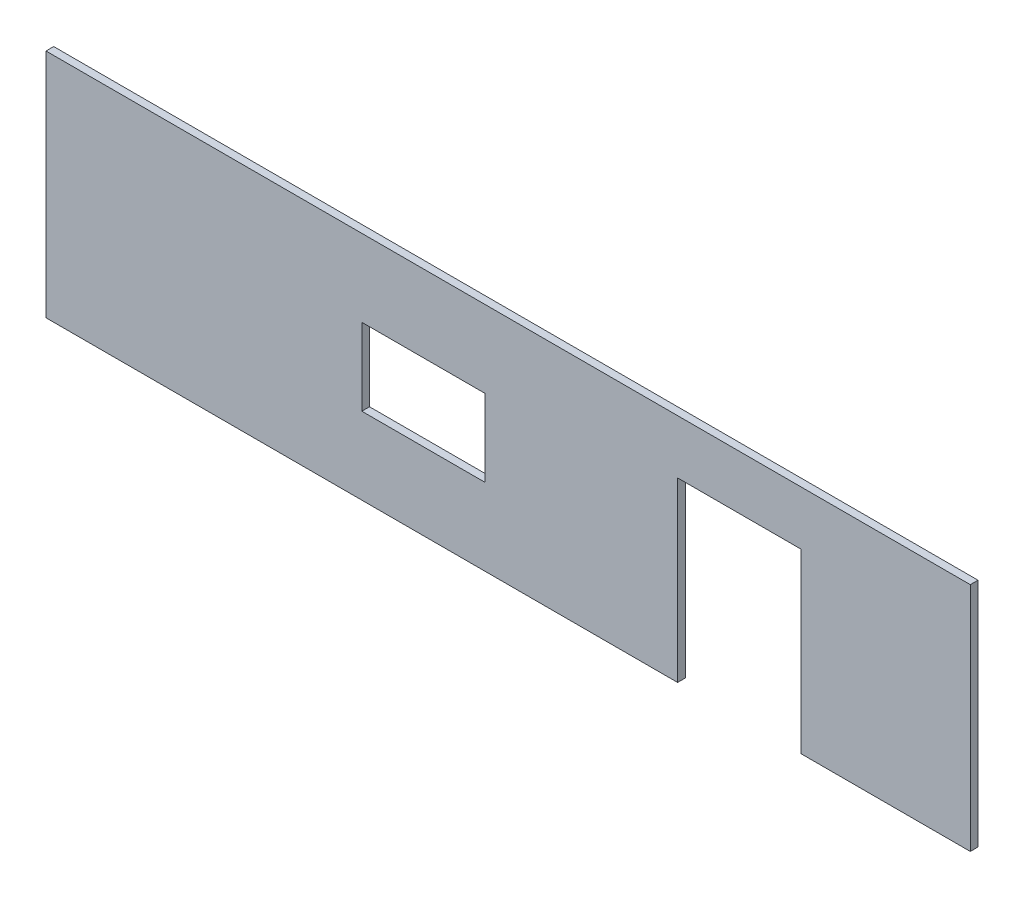
ISO-10303-21;
HEADER;
FILE_DESCRIPTION(('STEP AP214'),'2;1');
FILE_NAME('part.step','',(''),(''),'','','');
FILE_SCHEMA(('AUTOMOTIVE_DESIGN { 1 0 10303 214 1 1 1 1 }'));
ENDSEC;
DATA;
#1=APPLICATION_CONTEXT('core data for automotive mechanical design processes');
#2=APPLICATION_PROTOCOL_DEFINITION('international standard','automotive_design',2000,#1);
#3=PRODUCT_CONTEXT('',#1,'mechanical');
#4=PRODUCT('Part','Part','',(#3));
#5=PRODUCT_RELATED_PRODUCT_CATEGORY('part','',(#4));
#6=PRODUCT_DEFINITION_FORMATION('','',#4);
#7=PRODUCT_DEFINITION_CONTEXT('part definition',#1,'design');
#8=PRODUCT_DEFINITION('design','',#6,#7);
#9=PRODUCT_DEFINITION_SHAPE('','',#8);
#10=(LENGTH_UNIT() NAMED_UNIT(*) SI_UNIT(.MILLI.,.METRE.));
#11=(NAMED_UNIT(*) PLANE_ANGLE_UNIT() SI_UNIT($,.RADIAN.));
#12=(NAMED_UNIT(*) SI_UNIT($,.STERADIAN.) SOLID_ANGLE_UNIT());
#13=UNCERTAINTY_MEASURE_WITH_UNIT(LENGTH_MEASURE(1.E-05),#10,'distance_accuracy_value','');
#14=(GEOMETRIC_REPRESENTATION_CONTEXT(3) GLOBAL_UNCERTAINTY_ASSIGNED_CONTEXT((#13)) GLOBAL_UNIT_ASSIGNED_CONTEXT((#10,
#11,#12)) REPRESENTATION_CONTEXT('',''));
#15=CARTESIAN_POINT('',(0.,0.,0.));
#16=DIRECTION('',(0.,0.,1.));
#17=DIRECTION('',(1.,0.,0.));
#18=AXIS2_PLACEMENT_3D('',#15,#16,#17);
#19=CARTESIAN_POINT('',(0.,0.,5.));
#20=DIRECTION('',(0.,0.,-1.));
#21=DIRECTION('',(-1.,0.,0.));
#22=AXIS2_PLACEMENT_3D('',#19,#20,#21);
#23=PLANE('',#22);
#24=DIRECTION('',(1.,0.,0.));
#25=VECTOR('',#24,1.);
#26=CARTESIAN_POINT('',(190.,-75.,5.));
#27=LINE('',#26,#25);
#28=CARTESIAN_POINT('',(190.,-75.,5.));
#29=VERTEX_POINT('',#28);
#30=CARTESIAN_POINT('',(300.,-75.,5.));
#31=VERTEX_POINT('',#30);
#32=EDGE_CURVE('E158',#29,#31,#27,.T.);
#33=ORIENTED_EDGE('',*,*,#32,.T.);
#34=DIRECTION('',(0.,1.,0.));
#35=VECTOR('',#34,1.);
#36=CARTESIAN_POINT('',(300.,75.,5.));
#37=LINE('',#36,#35);
#38=CARTESIAN_POINT('',(300.,75.,5.));
#39=VERTEX_POINT('',#38);
#40=EDGE_CURVE('E161',#31,#39,#37,.T.);
#41=ORIENTED_EDGE('',*,*,#40,.T.);
#42=DIRECTION('',(-1.,0.,0.));
#43=VECTOR('',#42,1.);
#44=CARTESIAN_POINT('',(-300.,75.,5.));
#45=LINE('',#44,#43);
#46=CARTESIAN_POINT('',(-300.,75.,5.));
#47=VERTEX_POINT('',#46);
#48=EDGE_CURVE('E164',#39,#47,#45,.T.);
#49=ORIENTED_EDGE('',*,*,#48,.T.);
#50=DIRECTION('',(0.,-1.,0.));
#51=VECTOR('',#50,1.);
#52=CARTESIAN_POINT('',(-300.,75.,5.));
#53=LINE('',#52,#51);
#54=CARTESIAN_POINT('',(-300.,-75.,5.));
#55=VERTEX_POINT('',#54);
#56=EDGE_CURVE('E166',#47,#55,#53,.T.);
#57=ORIENTED_EDGE('',*,*,#56,.T.);
#58=DIRECTION('',(1.,0.,0.));
#59=VECTOR('',#58,1.);
#60=CARTESIAN_POINT('',(-300.,-75.,5.));
#61=LINE('',#60,#59);
#62=CARTESIAN_POINT('',(110.,-75.,5.));
#63=VERTEX_POINT('',#62);
#64=EDGE_CURVE('E168',#55,#63,#61,.T.);
#65=ORIENTED_EDGE('',*,*,#64,.T.);
#66=DIRECTION('',(0.,1.,0.));
#67=VECTOR('',#66,1.);
#68=CARTESIAN_POINT('',(110.,40.,5.));
#69=LINE('',#68,#67);
#70=CARTESIAN_POINT('',(110.,40.,5.));
#71=VERTEX_POINT('',#70);
#72=EDGE_CURVE('E170',#63,#71,#69,.T.);
#73=ORIENTED_EDGE('',*,*,#72,.T.);
#74=DIRECTION('',(1.,0.,0.));
#75=VECTOR('',#74,1.);
#76=CARTESIAN_POINT('',(110.,40.,5.));
#77=LINE('',#76,#75);
#78=CARTESIAN_POINT('',(190.,40.,5.));
#79=VERTEX_POINT('',#78);
#80=EDGE_CURVE('E172',#71,#79,#77,.T.);
#81=ORIENTED_EDGE('',*,*,#80,.T.);
#82=DIRECTION('',(0.,-1.,0.));
#83=VECTOR('',#82,1.);
#84=CARTESIAN_POINT('',(190.,-75.,5.));
#85=LINE('',#84,#83);
#86=EDGE_CURVE('E174',#79,#29,#85,.T.);
#87=ORIENTED_EDGE('',*,*,#86,.T.);
#88=EDGE_LOOP('',(#33,#41,#49,#57,#65,#73,#81,#87));
#89=FACE_BOUND('',#88,.T.);
#90=DIRECTION('',(0.,1.,0.));
#91=VECTOR('',#90,1.);
#92=CARTESIAN_POINT('',(-15.,25.,5.));
#93=LINE('',#92,#91);
#94=CARTESIAN_POINT('',(-15.,-25.,5.));
#95=VERTEX_POINT('',#94);
#96=CARTESIAN_POINT('',(-15.,25.,5.));
#97=VERTEX_POINT('',#96);
#98=EDGE_CURVE('E122',#95,#97,#93,.T.);
#99=ORIENTED_EDGE('',*,*,#98,.F.);
#100=DIRECTION('',(1.,0.,0.));
#101=VECTOR('',#100,1.);
#102=CARTESIAN_POINT('',(-95.,-25.,5.));
#103=LINE('',#102,#101);
#104=CARTESIAN_POINT('',(-95.,-25.,5.));
#105=VERTEX_POINT('',#104);
#106=EDGE_CURVE('E144',#105,#95,#103,.T.);
#107=ORIENTED_EDGE('',*,*,#106,.F.);
#108=DIRECTION('',(0.,-1.,0.));
#109=VECTOR('',#108,1.);
#110=CARTESIAN_POINT('',(-95.,25.,5.));
#111=LINE('',#110,#109);
#112=CARTESIAN_POINT('',(-95.,25.,5.));
#113=VERTEX_POINT('',#112);
#114=EDGE_CURVE('E142',#113,#105,#111,.T.);
#115=ORIENTED_EDGE('',*,*,#114,.F.);
#116=DIRECTION('',(-1.,0.,0.));
#117=VECTOR('',#116,1.);
#118=CARTESIAN_POINT('',(-95.,25.,5.));
#119=LINE('',#118,#117);
#120=EDGE_CURVE('E130',#97,#113,#119,.T.);
#121=ORIENTED_EDGE('',*,*,#120,.F.);
#122=EDGE_LOOP('',(#99,#107,#115,#121));
#123=FACE_BOUND('',#122,.T.);
#124=ADVANCED_FACE('F33',(#89,#123),#23,.F.);
#125=CARTESIAN_POINT('',(0.,0.,0.));
#126=DIRECTION('',(0.,0.,-1.));
#127=DIRECTION('',(-1.,0.,0.));
#128=AXIS2_PLACEMENT_3D('',#125,#126,#127);
#129=PLANE('',#128);
#130=DIRECTION('',(1.,0.,0.));
#131=VECTOR('',#130,1.);
#132=CARTESIAN_POINT('',(190.,-75.,0.));
#133=LINE('',#132,#131);
#134=CARTESIAN_POINT('',(190.,-75.,0.));
#135=VERTEX_POINT('',#134);
#136=CARTESIAN_POINT('',(300.,-75.,0.));
#137=VERTEX_POINT('',#136);
#138=EDGE_CURVE('E138',#135,#137,#133,.T.);
#139=ORIENTED_EDGE('',*,*,#138,.F.);
#140=DIRECTION('',(0.,-1.,0.));
#141=VECTOR('',#140,1.);
#142=CARTESIAN_POINT('',(190.,-75.,0.));
#143=LINE('',#142,#141);
#144=CARTESIAN_POINT('',(190.,40.,0.));
#145=VERTEX_POINT('',#144);
#146=EDGE_CURVE('E162',#145,#135,#143,.T.);
#147=ORIENTED_EDGE('',*,*,#146,.F.);
#148=DIRECTION('',(1.,0.,0.));
#149=VECTOR('',#148,1.);
#150=CARTESIAN_POINT('',(110.,40.,0.));
#151=LINE('',#150,#149);
#152=CARTESIAN_POINT('',(110.,40.,0.));
#153=VERTEX_POINT('',#152);
#154=EDGE_CURVE('E189',#153,#145,#151,.T.);
#155=ORIENTED_EDGE('',*,*,#154,.F.);
#156=DIRECTION('',(0.,1.,0.));
#157=VECTOR('',#156,1.);
#158=CARTESIAN_POINT('',(110.,40.,0.));
#159=LINE('',#158,#157);
#160=CARTESIAN_POINT('',(110.,-75.,0.));
#161=VERTEX_POINT('',#160);
#162=EDGE_CURVE('E187',#161,#153,#159,.T.);
#163=ORIENTED_EDGE('',*,*,#162,.F.);
#164=DIRECTION('',(1.,0.,0.));
#165=VECTOR('',#164,1.);
#166=CARTESIAN_POINT('',(-300.,-75.,0.));
#167=LINE('',#166,#165);
#168=CARTESIAN_POINT('',(-300.,-75.,0.));
#169=VERTEX_POINT('',#168);
#170=EDGE_CURVE('E185',#169,#161,#167,.T.);
#171=ORIENTED_EDGE('',*,*,#170,.F.);
#172=DIRECTION('',(0.,-1.,0.));
#173=VECTOR('',#172,1.);
#174=CARTESIAN_POINT('',(-300.,75.,0.));
#175=LINE('',#174,#173);
#176=CARTESIAN_POINT('',(-300.,75.,0.));
#177=VERTEX_POINT('',#176);
#178=EDGE_CURVE('E183',#177,#169,#175,.T.);
#179=ORIENTED_EDGE('',*,*,#178,.F.);
#180=DIRECTION('',(-1.,0.,0.));
#181=VECTOR('',#180,1.);
#182=CARTESIAN_POINT('',(-300.,75.,0.));
#183=LINE('',#182,#181);
#184=CARTESIAN_POINT('',(300.,75.,0.));
#185=VERTEX_POINT('',#184);
#186=EDGE_CURVE('E181',#185,#177,#183,.T.);
#187=ORIENTED_EDGE('',*,*,#186,.F.);
#188=DIRECTION('',(0.,1.,0.));
#189=VECTOR('',#188,1.);
#190=CARTESIAN_POINT('',(300.,75.,0.));
#191=LINE('',#190,#189);
#192=EDGE_CURVE('E179',#137,#185,#191,.T.);
#193=ORIENTED_EDGE('',*,*,#192,.F.);
#194=EDGE_LOOP('',(#139,#147,#155,#163,#171,#179,#187,#193));
#195=FACE_BOUND('',#194,.T.);
#196=DIRECTION('',(1.,0.,0.));
#197=VECTOR('',#196,1.);
#198=CARTESIAN_POINT('',(-95.,-25.,0.));
#199=LINE('',#198,#197);
#200=CARTESIAN_POINT('',(-95.,-25.,0.));
#201=VERTEX_POINT('',#200);
#202=CARTESIAN_POINT('',(-15.,-25.,0.));
#203=VERTEX_POINT('',#202);
#204=EDGE_CURVE('E131',#201,#203,#199,.T.);
#205=ORIENTED_EDGE('',*,*,#204,.T.);
#206=DIRECTION('',(0.,1.,0.));
#207=VECTOR('',#206,1.);
#208=CARTESIAN_POINT('',(-15.,25.,0.));
#209=LINE('',#208,#207);
#210=CARTESIAN_POINT('',(-15.,25.,0.));
#211=VERTEX_POINT('',#210);
#212=EDGE_CURVE('E56',#203,#211,#209,.T.);
#213=ORIENTED_EDGE('',*,*,#212,.T.);
#214=DIRECTION('',(-1.,0.,0.));
#215=VECTOR('',#214,1.);
#216=CARTESIAN_POINT('',(-95.,25.,0.));
#217=LINE('',#216,#215);
#218=CARTESIAN_POINT('',(-95.,25.,0.));
#219=VERTEX_POINT('',#218);
#220=EDGE_CURVE('E137',#211,#219,#217,.T.);
#221=ORIENTED_EDGE('',*,*,#220,.T.);
#222=DIRECTION('',(0.,-1.,0.));
#223=VECTOR('',#222,1.);
#224=CARTESIAN_POINT('',(-95.,25.,0.));
#225=LINE('',#224,#223);
#226=EDGE_CURVE('E150',#219,#201,#225,.T.);
#227=ORIENTED_EDGE('',*,*,#226,.T.);
#228=EDGE_LOOP('',(#205,#213,#221,#227));
#229=FACE_BOUND('',#228,.T.);
#230=ADVANCED_FACE('F219',(#195,#229),#129,.T.);
#231=CARTESIAN_POINT('',(190.,-75.,5.));
#232=DIRECTION('',(0.,1.,0.));
#233=DIRECTION('',(0.,0.,1.));
#234=AXIS2_PLACEMENT_3D('',#231,#232,#233);
#235=PLANE('',#234);
#236=ORIENTED_EDGE('',*,*,#138,.T.);
#237=DIRECTION('',(0.,0.,-1.));
#238=VECTOR('',#237,1.);
#239=CARTESIAN_POINT('',(300.,-75.,5.));
#240=LINE('',#239,#238);
#241=EDGE_CURVE('E11',#31,#137,#240,.T.);
#242=ORIENTED_EDGE('',*,*,#241,.F.);
#243=ORIENTED_EDGE('',*,*,#32,.F.);
#244=DIRECTION('',(0.,0.,-1.));
#245=VECTOR('',#244,1.);
#246=CARTESIAN_POINT('',(190.,-75.,5.));
#247=LINE('',#246,#245);
#248=EDGE_CURVE('E176',#29,#135,#247,.T.);
#249=ORIENTED_EDGE('',*,*,#248,.T.);
#250=EDGE_LOOP('',(#236,#242,#243,#249));
#251=FACE_BOUND('',#250,.T.);
#252=ADVANCED_FACE('F35',(#251),#235,.F.);
#253=CARTESIAN_POINT('',(300.,75.,5.));
#254=DIRECTION('',(-1.,0.,0.));
#255=DIRECTION('',(0.,0.,1.));
#256=AXIS2_PLACEMENT_3D('',#253,#254,#255);
#257=PLANE('',#256);
#258=ORIENTED_EDGE('',*,*,#192,.T.);
#259=DIRECTION('',(0.,0.,-1.));
#260=VECTOR('',#259,1.);
#261=CARTESIAN_POINT('',(300.,75.,5.));
#262=LINE('',#261,#260);
#263=EDGE_CURVE('E41',#39,#185,#262,.T.);
#264=ORIENTED_EDGE('',*,*,#263,.F.);
#265=ORIENTED_EDGE('',*,*,#40,.F.);
#266=ORIENTED_EDGE('',*,*,#241,.T.);
#267=EDGE_LOOP('',(#258,#264,#265,#266));
#268=FACE_BOUND('',#267,.T.);
#269=ADVANCED_FACE('F236',(#268),#257,.F.);
#270=CARTESIAN_POINT('',(-300.,75.,5.));
#271=DIRECTION('',(0.,-1.,0.));
#272=DIRECTION('',(0.,0.,-1.));
#273=AXIS2_PLACEMENT_3D('',#270,#271,#272);
#274=PLANE('',#273);
#275=ORIENTED_EDGE('',*,*,#186,.T.);
#276=DIRECTION('',(0.,0.,-1.));
#277=VECTOR('',#276,1.);
#278=CARTESIAN_POINT('',(-300.,75.,5.));
#279=LINE('',#278,#277);
#280=EDGE_CURVE('E206',#47,#177,#279,.T.);
#281=ORIENTED_EDGE('',*,*,#280,.F.);
#282=ORIENTED_EDGE('',*,*,#48,.F.);
#283=ORIENTED_EDGE('',*,*,#263,.T.);
#284=EDGE_LOOP('',(#275,#281,#282,#283));
#285=FACE_BOUND('',#284,.T.);
#286=ADVANCED_FACE('F213',(#285),#274,.F.);
#287=CARTESIAN_POINT('',(-300.,75.,5.));
#288=DIRECTION('',(1.,0.,0.));
#289=DIRECTION('',(0.,0.,-1.));
#290=AXIS2_PLACEMENT_3D('',#287,#288,#289);
#291=PLANE('',#290);
#292=ORIENTED_EDGE('',*,*,#178,.T.);
#293=DIRECTION('',(0.,0.,-1.));
#294=VECTOR('',#293,1.);
#295=CARTESIAN_POINT('',(-300.,-75.,5.));
#296=LINE('',#295,#294);
#297=EDGE_CURVE('E203',#55,#169,#296,.T.);
#298=ORIENTED_EDGE('',*,*,#297,.F.);
#299=ORIENTED_EDGE('',*,*,#56,.F.);
#300=ORIENTED_EDGE('',*,*,#280,.T.);
#301=EDGE_LOOP('',(#292,#298,#299,#300));
#302=FACE_BOUND('',#301,.T.);
#303=ADVANCED_FACE('F225',(#302),#291,.F.);
#304=CARTESIAN_POINT('',(-300.,-75.,5.));
#305=DIRECTION('',(0.,1.,0.));
#306=DIRECTION('',(-1.,0.,0.));
#307=AXIS2_PLACEMENT_3D('',#304,#305,#306);
#308=PLANE('',#307);
#309=ORIENTED_EDGE('',*,*,#170,.T.);
#310=DIRECTION('',(0.,0.,-1.));
#311=VECTOR('',#310,1.);
#312=CARTESIAN_POINT('',(110.,-75.,5.));
#313=LINE('',#312,#311);
#314=EDGE_CURVE('E200',#63,#161,#313,.T.);
#315=ORIENTED_EDGE('',*,*,#314,.F.);
#316=ORIENTED_EDGE('',*,*,#64,.F.);
#317=ORIENTED_EDGE('',*,*,#297,.T.);
#318=EDGE_LOOP('',(#309,#315,#316,#317));
#319=FACE_BOUND('',#318,.T.);
#320=ADVANCED_FACE('F229',(#319),#308,.F.);
#321=CARTESIAN_POINT('',(110.,40.,5.));
#322=DIRECTION('',(-1.,0.,0.));
#323=DIRECTION('',(0.,-1.,0.));
#324=AXIS2_PLACEMENT_3D('',#321,#322,#323);
#325=PLANE('',#324);
#326=ORIENTED_EDGE('',*,*,#162,.T.);
#327=DIRECTION('',(0.,0.,-1.));
#328=VECTOR('',#327,1.);
#329=CARTESIAN_POINT('',(110.,40.,5.));
#330=LINE('',#329,#328);
#331=EDGE_CURVE('E197',#71,#153,#330,.T.);
#332=ORIENTED_EDGE('',*,*,#331,.F.);
#333=ORIENTED_EDGE('',*,*,#72,.F.);
#334=ORIENTED_EDGE('',*,*,#314,.T.);
#335=EDGE_LOOP('',(#326,#332,#333,#334));
#336=FACE_BOUND('',#335,.T.);
#337=ADVANCED_FACE('F249',(#336),#325,.F.);
#338=CARTESIAN_POINT('',(110.,40.,5.));
#339=DIRECTION('',(0.,1.,0.));
#340=DIRECTION('',(-1.,0.,0.));
#341=AXIS2_PLACEMENT_3D('',#338,#339,#340);
#342=PLANE('',#341);
#343=ORIENTED_EDGE('',*,*,#154,.T.);
#344=DIRECTION('',(0.,0.,-1.));
#345=VECTOR('',#344,1.);
#346=CARTESIAN_POINT('',(190.,40.,5.));
#347=LINE('',#346,#345);
#348=EDGE_CURVE('E194',#79,#145,#347,.T.);
#349=ORIENTED_EDGE('',*,*,#348,.F.);
#350=ORIENTED_EDGE('',*,*,#80,.F.);
#351=ORIENTED_EDGE('',*,*,#331,.T.);
#352=EDGE_LOOP('',(#343,#349,#350,#351));
#353=FACE_BOUND('',#352,.T.);
#354=ADVANCED_FACE('F247',(#353),#342,.F.);
#355=CARTESIAN_POINT('',(190.,-75.,5.));
#356=DIRECTION('',(1.,0.,0.));
#357=DIRECTION('',(0.,1.,0.));
#358=AXIS2_PLACEMENT_3D('',#355,#356,#357);
#359=PLANE('',#358);
#360=ORIENTED_EDGE('',*,*,#146,.T.);
#361=ORIENTED_EDGE('',*,*,#248,.F.);
#362=ORIENTED_EDGE('',*,*,#86,.F.);
#363=ORIENTED_EDGE('',*,*,#348,.T.);
#364=EDGE_LOOP('',(#360,#361,#362,#363));
#365=FACE_BOUND('',#364,.T.);
#366=ADVANCED_FACE('F242',(#365),#359,.F.);
#367=CARTESIAN_POINT('',(-15.,25.,5.));
#368=DIRECTION('',(-1.,0.,0.));
#369=DIRECTION('',(0.,-1.,0.));
#370=AXIS2_PLACEMENT_3D('',#367,#368,#369);
#371=PLANE('',#370);
#372=ORIENTED_EDGE('',*,*,#212,.F.);
#373=DIRECTION('',(0.,0.,-1.));
#374=VECTOR('',#373,1.);
#375=CARTESIAN_POINT('',(-15.,-25.,5.));
#376=LINE('',#375,#374);
#377=EDGE_CURVE('E126',#95,#203,#376,.T.);
#378=ORIENTED_EDGE('',*,*,#377,.F.);
#379=ORIENTED_EDGE('',*,*,#98,.T.);
#380=DIRECTION('',(0.,0.,-1.));
#381=VECTOR('',#380,1.);
#382=CARTESIAN_POINT('',(-15.,25.,5.));
#383=LINE('',#382,#381);
#384=EDGE_CURVE('E125',#97,#211,#383,.T.);
#385=ORIENTED_EDGE('',*,*,#384,.T.);
#386=EDGE_LOOP('',(#372,#378,#379,#385));
#387=FACE_BOUND('',#386,.T.);
#388=ADVANCED_FACE('F124',(#387),#371,.T.);
#389=CARTESIAN_POINT('',(-95.,25.,5.));
#390=DIRECTION('',(0.,-1.,0.));
#391=DIRECTION('',(0.,0.,-1.));
#392=AXIS2_PLACEMENT_3D('',#389,#390,#391);
#393=PLANE('',#392);
#394=ORIENTED_EDGE('',*,*,#220,.F.);
#395=ORIENTED_EDGE('',*,*,#384,.F.);
#396=ORIENTED_EDGE('',*,*,#120,.T.);
#397=DIRECTION('',(0.,0.,-1.));
#398=VECTOR('',#397,1.);
#399=CARTESIAN_POINT('',(-95.,25.,5.));
#400=LINE('',#399,#398);
#401=EDGE_CURVE('E139',#113,#219,#400,.T.);
#402=ORIENTED_EDGE('',*,*,#401,.T.);
#403=EDGE_LOOP('',(#394,#395,#396,#402));
#404=FACE_BOUND('',#403,.T.);
#405=ADVANCED_FACE('F134',(#404),#393,.T.);
#406=CARTESIAN_POINT('',(-95.,25.,5.));
#407=DIRECTION('',(1.,0.,0.));
#408=DIRECTION('',(0.,0.,-1.));
#409=AXIS2_PLACEMENT_3D('',#406,#407,#408);
#410=PLANE('',#409);
#411=ORIENTED_EDGE('',*,*,#226,.F.);
#412=ORIENTED_EDGE('',*,*,#401,.F.);
#413=ORIENTED_EDGE('',*,*,#114,.T.);
#414=DIRECTION('',(0.,0.,-1.));
#415=VECTOR('',#414,1.);
#416=CARTESIAN_POINT('',(-95.,-25.,5.));
#417=LINE('',#416,#415);
#418=EDGE_CURVE('E48',#105,#201,#417,.T.);
#419=ORIENTED_EDGE('',*,*,#418,.T.);
#420=EDGE_LOOP('',(#411,#412,#413,#419));
#421=FACE_BOUND('',#420,.T.);
#422=ADVANCED_FACE('F274',(#421),#410,.T.);
#423=CARTESIAN_POINT('',(-95.,-25.,5.));
#424=DIRECTION('',(0.,1.,0.));
#425=DIRECTION('',(0.,0.,1.));
#426=AXIS2_PLACEMENT_3D('',#423,#424,#425);
#427=PLANE('',#426);
#428=ORIENTED_EDGE('',*,*,#204,.F.);
#429=ORIENTED_EDGE('',*,*,#418,.F.);
#430=ORIENTED_EDGE('',*,*,#106,.T.);
#431=ORIENTED_EDGE('',*,*,#377,.T.);
#432=EDGE_LOOP('',(#428,#429,#430,#431));
#433=FACE_BOUND('',#432,.T.);
#434=ADVANCED_FACE('F278',(#433),#427,.T.);
#435=CLOSED_SHELL('',(#124,#230,#252,#269,#286,#303,#320,#337,#354,#366,#388,#405,#422,#434));
#436=MANIFOLD_SOLID_BREP('B2',#435);
#437=ADVANCED_BREP_SHAPE_REPRESENTATION('',(#18,#436),#14);
#438=SHAPE_DEFINITION_REPRESENTATION(#9,#437);
ENDSEC;
END-ISO-10303-21;
